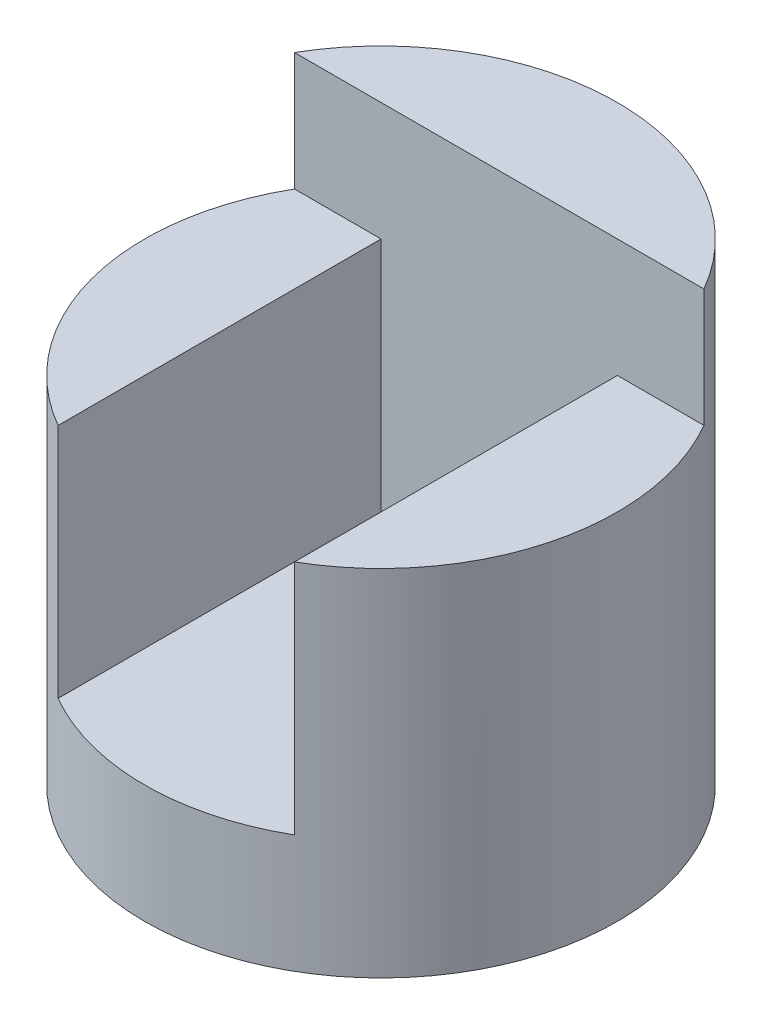
ISO-10303-21;
HEADER;
FILE_DESCRIPTION(('STEP AP214'),'2;1');
FILE_NAME('part.step','',(''),(''),'','','');
FILE_SCHEMA(('AUTOMOTIVE_DESIGN { 1 0 10303 214 1 1 1 1 }'));
ENDSEC;
DATA;
#1=APPLICATION_CONTEXT('core data for automotive mechanical design processes');
#2=APPLICATION_PROTOCOL_DEFINITION('international standard','automotive_design',2000,#1);
#3=PRODUCT_CONTEXT('',#1,'mechanical');
#4=PRODUCT('Part','Part','',(#3));
#5=PRODUCT_RELATED_PRODUCT_CATEGORY('part','',(#4));
#6=PRODUCT_DEFINITION_FORMATION('','',#4);
#7=PRODUCT_DEFINITION_CONTEXT('part definition',#1,'design');
#8=PRODUCT_DEFINITION('design','',#6,#7);
#9=PRODUCT_DEFINITION_SHAPE('','',#8);
#10=(LENGTH_UNIT() NAMED_UNIT(*) SI_UNIT(.MILLI.,.METRE.));
#11=(NAMED_UNIT(*) PLANE_ANGLE_UNIT() SI_UNIT($,.RADIAN.));
#12=(NAMED_UNIT(*) SI_UNIT($,.STERADIAN.) SOLID_ANGLE_UNIT());
#13=UNCERTAINTY_MEASURE_WITH_UNIT(LENGTH_MEASURE(1.E-05),#10,'distance_accuracy_value','');
#14=(GEOMETRIC_REPRESENTATION_CONTEXT(3) GLOBAL_UNCERTAINTY_ASSIGNED_CONTEXT((#13)) GLOBAL_UNIT_ASSIGNED_CONTEXT((#10,
#11,#12)) REPRESENTATION_CONTEXT('',''));
#15=CARTESIAN_POINT('',(0.,0.,0.));
#16=DIRECTION('',(0.,0.,1.));
#17=DIRECTION('',(1.,0.,0.));
#18=AXIS2_PLACEMENT_3D('',#15,#16,#17);
#19=CARTESIAN_POINT('',(0.,4.,0.));
#20=DIRECTION('',(0.,-1.,0.));
#21=DIRECTION('',(0.,0.,-1.));
#22=AXIS2_PLACEMENT_3D('',#19,#20,#21);
#23=CYLINDRICAL_SURFACE('',#22,2.);
#24=CARTESIAN_POINT('',(0.,0.,0.));
#25=DIRECTION('',(0.,1.,0.));
#26=DIRECTION('',(0.,0.,1.));
#27=AXIS2_PLACEMENT_3D('',#24,#25,#26);
#28=CIRCLE('',#27,2.);
#29=CARTESIAN_POINT('',(0.,0.,2.));
#30=VERTEX_POINT('',#29);
#31=EDGE_CURVE('E118',#30,#30,#28,.T.);
#32=ORIENTED_EDGE('',*,*,#31,.T.);
#33=EDGE_LOOP('',(#32));
#34=FACE_BOUND('',#33,.T.);
#35=DIRECTION('',(0.,-1.,0.));
#36=VECTOR('',#35,1.);
#37=CARTESIAN_POINT('',(1.73205080756888,4.,-1.));
#38=LINE('',#37,#36);
#39=CARTESIAN_POINT('',(1.73205080756888,4.,-1.));
#40=VERTEX_POINT('',#39);
#41=CARTESIAN_POINT('',(1.73205080756888,3.,-1.));
#42=VERTEX_POINT('',#41);
#43=EDGE_CURVE('E47',#40,#42,#38,.T.);
#44=ORIENTED_EDGE('',*,*,#43,.T.);
#45=CARTESIAN_POINT('',(0.,3.,0.));
#46=DIRECTION('',(0.,1.,0.));
#47=DIRECTION('',(0.,0.,1.));
#48=AXIS2_PLACEMENT_3D('',#45,#46,#47);
#49=CIRCLE('',#48,2.);
#50=CARTESIAN_POINT('',(1.,3.,1.73205080756888));
#51=VERTEX_POINT('',#50);
#52=EDGE_CURVE('E11',#51,#42,#49,.T.);
#53=ORIENTED_EDGE('',*,*,#52,.F.);
#54=DIRECTION('',(0.,-1.,0.));
#55=VECTOR('',#54,1.);
#56=CARTESIAN_POINT('',(1.,4.,1.73205080756888));
#57=LINE('',#56,#55);
#58=CARTESIAN_POINT('',(1.,1.,1.73205080756888));
#59=VERTEX_POINT('',#58);
#60=EDGE_CURVE('E40',#59,#51,#57,.F.);
#61=ORIENTED_EDGE('',*,*,#60,.F.);
#62=CARTESIAN_POINT('',(0.,1.,0.));
#63=DIRECTION('',(0.,1.,0.));
#64=DIRECTION('',(-1.,0.,0.));
#65=AXIS2_PLACEMENT_3D('',#62,#63,#64);
#66=CIRCLE('',#65,2.);
#67=CARTESIAN_POINT('',(-1.,1.,1.73205080756888));
#68=VERTEX_POINT('',#67);
#69=EDGE_CURVE('E129',#68,#59,#66,.T.);
#70=ORIENTED_EDGE('',*,*,#69,.F.);
#71=DIRECTION('',(0.,-1.,0.));
#72=VECTOR('',#71,1.);
#73=CARTESIAN_POINT('',(-1.,4.,1.73205080756888));
#74=LINE('',#73,#72);
#75=CARTESIAN_POINT('',(-1.,3.,1.73205080756888));
#76=VERTEX_POINT('',#75);
#77=EDGE_CURVE('E127',#76,#68,#74,.T.);
#78=ORIENTED_EDGE('',*,*,#77,.F.);
#79=CARTESIAN_POINT('',(0.,3.,0.));
#80=DIRECTION('',(0.,1.,0.));
#81=DIRECTION('',(-1.,0.,0.));
#82=AXIS2_PLACEMENT_3D('',#79,#80,#81);
#83=CIRCLE('',#82,2.);
#84=CARTESIAN_POINT('',(-1.73205080756888,3.,-1.));
#85=VERTEX_POINT('',#84);
#86=EDGE_CURVE('E55',#85,#76,#83,.T.);
#87=ORIENTED_EDGE('',*,*,#86,.F.);
#88=DIRECTION('',(0.,-1.,0.));
#89=VECTOR('',#88,1.);
#90=CARTESIAN_POINT('',(-1.73205080756888,4.,-1.));
#91=LINE('',#90,#89);
#92=CARTESIAN_POINT('',(-1.73205080756888,4.,-1.));
#93=VERTEX_POINT('',#92);
#94=EDGE_CURVE('E90',#85,#93,#91,.F.);
#95=ORIENTED_EDGE('',*,*,#94,.T.);
#96=CARTESIAN_POINT('',(0.,4.,0.));
#97=DIRECTION('',(0.,1.,0.));
#98=DIRECTION('',(0.,0.,1.));
#99=AXIS2_PLACEMENT_3D('',#96,#97,#98);
#100=CIRCLE('',#99,2.);
#101=EDGE_CURVE('E119',#40,#93,#100,.T.);
#102=ORIENTED_EDGE('',*,*,#101,.F.);
#103=EDGE_LOOP('',(#44,#53,#61,#70,#78,#87,#95,#102));
#104=FACE_BOUND('',#103,.T.);
#105=ADVANCED_FACE('F33',(#34,#104),#23,.T.);
#106=CARTESIAN_POINT('',(0.,4.,0.));
#107=DIRECTION('',(0.,1.,0.));
#108=DIRECTION('',(0.,0.,1.));
#109=AXIS2_PLACEMENT_3D('',#106,#107,#108);
#110=PLANE('',#109);
#111=DIRECTION('',(-1.,0.,0.));
#112=VECTOR('',#111,1.);
#113=CARTESIAN_POINT('',(0.,4.,-1.));
#114=LINE('',#113,#112);
#115=EDGE_CURVE('E122',#40,#93,#114,.T.);
#116=ORIENTED_EDGE('',*,*,#115,.F.);
#117=ORIENTED_EDGE('',*,*,#101,.T.);
#118=EDGE_LOOP('',(#116,#117));
#119=FACE_BOUND('',#118,.T.);
#120=ADVANCED_FACE('F144',(#119),#110,.T.);
#121=CARTESIAN_POINT('',(0.,0.,0.));
#122=DIRECTION('',(0.,1.,0.));
#123=DIRECTION('',(0.,0.,1.));
#124=AXIS2_PLACEMENT_3D('',#121,#122,#123);
#125=PLANE('',#124);
#126=ORIENTED_EDGE('',*,*,#31,.F.);
#127=EDGE_LOOP('',(#126));
#128=FACE_BOUND('',#127,.T.);
#129=ADVANCED_FACE('F146',(#128),#125,.F.);
#130=CARTESIAN_POINT('',(-1.,3.,3.));
#131=DIRECTION('',(0.,1.,0.));
#132=DIRECTION('',(-1.,0.,0.));
#133=AXIS2_PLACEMENT_3D('',#130,#131,#132);
#134=PLANE('',#133);
#135=ORIENTED_EDGE('',*,*,#86,.T.);
#136=DIRECTION('',(0.,0.,-1.));
#137=VECTOR('',#136,1.);
#138=CARTESIAN_POINT('',(-1.,3.,3.));
#139=LINE('',#138,#137);
#140=CARTESIAN_POINT('',(-1.,3.,-1.));
#141=VERTEX_POINT('',#140);
#142=EDGE_CURVE('E83',#76,#141,#139,.T.);
#143=ORIENTED_EDGE('',*,*,#142,.T.);
#144=DIRECTION('',(1.,0.,0.));
#145=VECTOR('',#144,1.);
#146=CARTESIAN_POINT('',(-1.,3.,-1.));
#147=LINE('',#146,#145);
#148=EDGE_CURVE('E86',#85,#141,#147,.T.);
#149=ORIENTED_EDGE('',*,*,#148,.F.);
#150=EDGE_LOOP('',(#135,#143,#149));
#151=FACE_BOUND('',#150,.T.);
#152=ADVANCED_FACE('F85',(#151),#134,.T.);
#153=CARTESIAN_POINT('',(-1.,1.,3.));
#154=DIRECTION('',(1.,0.,0.));
#155=DIRECTION('',(0.,0.,-1.));
#156=AXIS2_PLACEMENT_3D('',#153,#154,#155);
#157=PLANE('',#156);
#158=ORIENTED_EDGE('',*,*,#77,.T.);
#159=DIRECTION('',(0.,0.,-1.));
#160=VECTOR('',#159,1.);
#161=CARTESIAN_POINT('',(-1.,1.,3.));
#162=LINE('',#161,#160);
#163=CARTESIAN_POINT('',(-1.,1.,-1.));
#164=VERTEX_POINT('',#163);
#165=EDGE_CURVE('E91',#68,#164,#162,.T.);
#166=ORIENTED_EDGE('',*,*,#165,.T.);
#167=DIRECTION('',(0.,-1.,0.));
#168=VECTOR('',#167,1.);
#169=CARTESIAN_POINT('',(-1.,1.,-1.));
#170=LINE('',#169,#168);
#171=EDGE_CURVE('E96',#141,#164,#170,.T.);
#172=ORIENTED_EDGE('',*,*,#171,.F.);
#173=ORIENTED_EDGE('',*,*,#142,.F.);
#174=EDGE_LOOP('',(#158,#166,#172,#173));
#175=FACE_BOUND('',#174,.T.);
#176=ADVANCED_FACE('F99',(#175),#157,.T.);
#177=CARTESIAN_POINT('',(1.,1.,3.));
#178=DIRECTION('',(0.,1.,0.));
#179=DIRECTION('',(-1.,0.,0.));
#180=AXIS2_PLACEMENT_3D('',#177,#178,#179);
#181=PLANE('',#180);
#182=ORIENTED_EDGE('',*,*,#69,.T.);
#183=DIRECTION('',(0.,0.,-1.));
#184=VECTOR('',#183,1.);
#185=CARTESIAN_POINT('',(1.,1.,3.));
#186=LINE('',#185,#184);
#187=CARTESIAN_POINT('',(1.,1.,-1.));
#188=VERTEX_POINT('',#187);
#189=EDGE_CURVE('E113',#59,#188,#186,.T.);
#190=ORIENTED_EDGE('',*,*,#189,.T.);
#191=DIRECTION('',(1.,0.,0.));
#192=VECTOR('',#191,1.);
#193=CARTESIAN_POINT('',(1.,1.,-1.));
#194=LINE('',#193,#192);
#195=EDGE_CURVE('E102',#164,#188,#194,.T.);
#196=ORIENTED_EDGE('',*,*,#195,.F.);
#197=ORIENTED_EDGE('',*,*,#165,.F.);
#198=EDGE_LOOP('',(#182,#190,#196,#197));
#199=FACE_BOUND('',#198,.T.);
#200=ADVANCED_FACE('F159',(#199),#181,.T.);
#201=CARTESIAN_POINT('',(1.,3.,3.));
#202=DIRECTION('',(-1.,0.,0.));
#203=DIRECTION('',(0.,-1.,0.));
#204=AXIS2_PLACEMENT_3D('',#201,#202,#203);
#205=PLANE('',#204);
#206=ORIENTED_EDGE('',*,*,#60,.T.);
#207=DIRECTION('',(0.,0.,-1.));
#208=VECTOR('',#207,1.);
#209=CARTESIAN_POINT('',(1.,3.,3.));
#210=LINE('',#209,#208);
#211=CARTESIAN_POINT('',(1.,3.,-1.));
#212=VERTEX_POINT('',#211);
#213=EDGE_CURVE('E111',#51,#212,#210,.T.);
#214=ORIENTED_EDGE('',*,*,#213,.T.);
#215=DIRECTION('',(0.,1.,0.));
#216=VECTOR('',#215,1.);
#217=CARTESIAN_POINT('',(1.,3.,-1.));
#218=LINE('',#217,#216);
#219=EDGE_CURVE('E104',#188,#212,#218,.T.);
#220=ORIENTED_EDGE('',*,*,#219,.F.);
#221=ORIENTED_EDGE('',*,*,#189,.F.);
#222=EDGE_LOOP('',(#206,#214,#220,#221));
#223=FACE_BOUND('',#222,.T.);
#224=ADVANCED_FACE('F134',(#223),#205,.T.);
#225=CARTESIAN_POINT('',(2.,3.,3.));
#226=DIRECTION('',(0.,1.,0.));
#227=DIRECTION('',(0.,0.,1.));
#228=AXIS2_PLACEMENT_3D('',#225,#226,#227);
#229=PLANE('',#228);
#230=ORIENTED_EDGE('',*,*,#52,.T.);
#231=DIRECTION('',(1.,0.,0.));
#232=VECTOR('',#231,1.);
#233=CARTESIAN_POINT('',(2.,3.,-1.));
#234=LINE('',#233,#232);
#235=EDGE_CURVE('E109',#212,#42,#234,.T.);
#236=ORIENTED_EDGE('',*,*,#235,.F.);
#237=ORIENTED_EDGE('',*,*,#213,.F.);
#238=EDGE_LOOP('',(#230,#236,#237));
#239=FACE_BOUND('',#238,.T.);
#240=ADVANCED_FACE('F141',(#239),#229,.T.);
#241=CARTESIAN_POINT('',(0.,0.,-1.));
#242=DIRECTION('',(0.,0.,-1.));
#243=DIRECTION('',(-1.,0.,0.));
#244=AXIS2_PLACEMENT_3D('',#241,#242,#243);
#245=PLANE('',#244);
#246=ORIENTED_EDGE('',*,*,#115,.T.);
#247=ORIENTED_EDGE('',*,*,#94,.F.);
#248=ORIENTED_EDGE('',*,*,#148,.T.);
#249=ORIENTED_EDGE('',*,*,#171,.T.);
#250=ORIENTED_EDGE('',*,*,#195,.T.);
#251=ORIENTED_EDGE('',*,*,#219,.T.);
#252=ORIENTED_EDGE('',*,*,#235,.T.);
#253=ORIENTED_EDGE('',*,*,#43,.F.);
#254=EDGE_LOOP('',(#246,#247,#248,#249,#250,#251,#252,#253));
#255=FACE_BOUND('',#254,.T.);
#256=ADVANCED_FACE('F94',(#255),#245,.F.);
#257=CLOSED_SHELL('',(#105,#120,#129,#152,#176,#200,#224,#240,#256));
#258=MANIFOLD_SOLID_BREP('B2',#257);
#259=ADVANCED_BREP_SHAPE_REPRESENTATION('',(#18,#258),#14);
#260=SHAPE_DEFINITION_REPRESENTATION(#9,#259);
ENDSEC;
END-ISO-10303-21;
